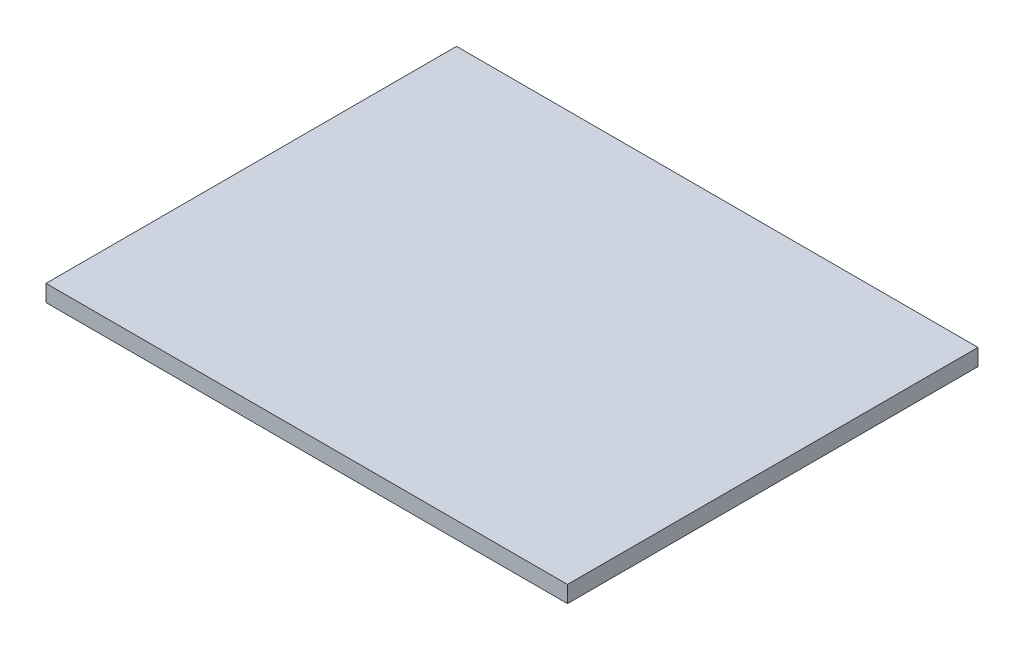
ISO-10303-21;
HEADER;
FILE_DESCRIPTION(('STEP AP214'),'2;1');
FILE_NAME('part.step','',(''),(''),'','','');
FILE_SCHEMA(('AUTOMOTIVE_DESIGN { 1 0 10303 214 1 1 1 1 }'));
ENDSEC;
DATA;
#1=APPLICATION_CONTEXT('core data for automotive mechanical design processes');
#2=APPLICATION_PROTOCOL_DEFINITION('international standard','automotive_design',2000,#1);
#3=PRODUCT_CONTEXT('',#1,'mechanical');
#4=PRODUCT('Part','Part','',(#3));
#5=PRODUCT_RELATED_PRODUCT_CATEGORY('part','',(#4));
#6=PRODUCT_DEFINITION_FORMATION('','',#4);
#7=PRODUCT_DEFINITION_CONTEXT('part definition',#1,'design');
#8=PRODUCT_DEFINITION('design','',#6,#7);
#9=PRODUCT_DEFINITION_SHAPE('','',#8);
#10=(LENGTH_UNIT() NAMED_UNIT(*) SI_UNIT(.MILLI.,.METRE.));
#11=(NAMED_UNIT(*) PLANE_ANGLE_UNIT() SI_UNIT($,.RADIAN.));
#12=(NAMED_UNIT(*) SI_UNIT($,.STERADIAN.) SOLID_ANGLE_UNIT());
#13=UNCERTAINTY_MEASURE_WITH_UNIT(LENGTH_MEASURE(1.E-05),#10,'distance_accuracy_value','');
#14=(GEOMETRIC_REPRESENTATION_CONTEXT(3) GLOBAL_UNCERTAINTY_ASSIGNED_CONTEXT((#13)) GLOBAL_UNIT_ASSIGNED_CONTEXT((#10,
#11,#12)) REPRESENTATION_CONTEXT('',''));
#15=CARTESIAN_POINT('',(0.,0.,0.));
#16=DIRECTION('',(0.,0.,1.));
#17=DIRECTION('',(1.,0.,0.));
#18=AXIS2_PLACEMENT_3D('',#15,#16,#17);
#19=CARTESIAN_POINT('',(47.,3.,-37.));
#20=DIRECTION('',(-1.,0.,0.));
#21=DIRECTION('',(0.,0.,1.));
#22=AXIS2_PLACEMENT_3D('',#19,#20,#21);
#23=PLANE('',#22);
#24=DIRECTION('',(0.,0.,-1.));
#25=VECTOR('',#24,1.);
#26=CARTESIAN_POINT('',(47.,0.,-37.));
#27=LINE('',#26,#25);
#28=CARTESIAN_POINT('',(47.,0.,37.));
#29=VERTEX_POINT('',#28);
#30=CARTESIAN_POINT('',(47.,0.,-37.));
#31=VERTEX_POINT('',#30);
#32=EDGE_CURVE('E113',#29,#31,#27,.T.);
#33=ORIENTED_EDGE('',*,*,#32,.T.);
#34=DIRECTION('',(0.,-1.,0.));
#35=VECTOR('',#34,1.);
#36=CARTESIAN_POINT('',(47.,3.,-37.));
#37=LINE('',#36,#35);
#38=CARTESIAN_POINT('',(47.,3.,-37.));
#39=VERTEX_POINT('',#38);
#40=EDGE_CURVE('E11',#39,#31,#37,.T.);
#41=ORIENTED_EDGE('',*,*,#40,.F.);
#42=DIRECTION('',(0.,0.,-1.));
#43=VECTOR('',#42,1.);
#44=CARTESIAN_POINT('',(47.,3.,-37.));
#45=LINE('',#44,#43);
#46=CARTESIAN_POINT('',(47.,3.,37.));
#47=VERTEX_POINT('',#46);
#48=EDGE_CURVE('E97',#47,#39,#45,.T.);
#49=ORIENTED_EDGE('',*,*,#48,.F.);
#50=DIRECTION('',(0.,-1.,0.));
#51=VECTOR('',#50,1.);
#52=CARTESIAN_POINT('',(47.,3.,37.));
#53=LINE('',#52,#51);
#54=EDGE_CURVE('E109',#47,#29,#53,.T.);
#55=ORIENTED_EDGE('',*,*,#54,.T.);
#56=EDGE_LOOP('',(#33,#41,#49,#55));
#57=FACE_BOUND('',#56,.T.);
#58=ADVANCED_FACE('F45',(#57),#23,.F.);
#59=CARTESIAN_POINT('',(-47.,3.,-37.));
#60=DIRECTION('',(0.,0.,1.));
#61=DIRECTION('',(1.,0.,0.));
#62=AXIS2_PLACEMENT_3D('',#59,#60,#61);
#63=PLANE('',#62);
#64=DIRECTION('',(-1.,0.,0.));
#65=VECTOR('',#64,1.);
#66=CARTESIAN_POINT('',(-47.,0.,-37.));
#67=LINE('',#66,#65);
#68=CARTESIAN_POINT('',(-47.,0.,-37.));
#69=VERTEX_POINT('',#68);
#70=EDGE_CURVE('E102',#31,#69,#67,.T.);
#71=ORIENTED_EDGE('',*,*,#70,.T.);
#72=DIRECTION('',(0.,-1.,0.));
#73=VECTOR('',#72,1.);
#74=CARTESIAN_POINT('',(-47.,3.,-37.));
#75=LINE('',#74,#73);
#76=CARTESIAN_POINT('',(-47.,3.,-37.));
#77=VERTEX_POINT('',#76);
#78=EDGE_CURVE('E54',#77,#69,#75,.T.);
#79=ORIENTED_EDGE('',*,*,#78,.F.);
#80=DIRECTION('',(-1.,0.,0.));
#81=VECTOR('',#80,1.);
#82=CARTESIAN_POINT('',(-47.,3.,-37.));
#83=LINE('',#82,#81);
#84=EDGE_CURVE('E92',#39,#77,#83,.T.);
#85=ORIENTED_EDGE('',*,*,#84,.F.);
#86=ORIENTED_EDGE('',*,*,#40,.T.);
#87=EDGE_LOOP('',(#71,#79,#85,#86));
#88=FACE_BOUND('',#87,.T.);
#89=ADVANCED_FACE('F101',(#88),#63,.F.);
#90=CARTESIAN_POINT('',(-47.,3.,-37.));
#91=DIRECTION('',(1.,0.,0.));
#92=DIRECTION('',(0.,0.,-1.));
#93=AXIS2_PLACEMENT_3D('',#90,#91,#92);
#94=PLANE('',#93);
#95=DIRECTION('',(0.,0.,1.));
#96=VECTOR('',#95,1.);
#97=CARTESIAN_POINT('',(-47.,0.,-37.));
#98=LINE('',#97,#96);
#99=CARTESIAN_POINT('',(-47.,0.,37.));
#100=VERTEX_POINT('',#99);
#101=EDGE_CURVE('E79',#69,#100,#98,.T.);
#102=ORIENTED_EDGE('',*,*,#101,.T.);
#103=DIRECTION('',(0.,-1.,0.));
#104=VECTOR('',#103,1.);
#105=CARTESIAN_POINT('',(-47.,3.,37.));
#106=LINE('',#105,#104);
#107=CARTESIAN_POINT('',(-47.,3.,37.));
#108=VERTEX_POINT('',#107);
#109=EDGE_CURVE('E104',#108,#100,#106,.T.);
#110=ORIENTED_EDGE('',*,*,#109,.F.);
#111=DIRECTION('',(0.,0.,1.));
#112=VECTOR('',#111,1.);
#113=CARTESIAN_POINT('',(-47.,3.,-37.));
#114=LINE('',#113,#112);
#115=EDGE_CURVE('E95',#77,#108,#114,.T.);
#116=ORIENTED_EDGE('',*,*,#115,.F.);
#117=ORIENTED_EDGE('',*,*,#78,.T.);
#118=EDGE_LOOP('',(#102,#110,#116,#117));
#119=FACE_BOUND('',#118,.T.);
#120=ADVANCED_FACE('F105',(#119),#94,.F.);
#121=CARTESIAN_POINT('',(-47.,3.,37.));
#122=DIRECTION('',(0.,0.,-1.));
#123=DIRECTION('',(-1.,0.,0.));
#124=AXIS2_PLACEMENT_3D('',#121,#122,#123);
#125=PLANE('',#124);
#126=DIRECTION('',(1.,0.,0.));
#127=VECTOR('',#126,1.);
#128=CARTESIAN_POINT('',(-47.,0.,37.));
#129=LINE('',#128,#127);
#130=EDGE_CURVE('E85',#100,#29,#129,.T.);
#131=ORIENTED_EDGE('',*,*,#130,.T.);
#132=ORIENTED_EDGE('',*,*,#54,.F.);
#133=DIRECTION('',(1.,0.,0.));
#134=VECTOR('',#133,1.);
#135=CARTESIAN_POINT('',(-47.,3.,37.));
#136=LINE('',#135,#134);
#137=EDGE_CURVE('E62',#108,#47,#136,.T.);
#138=ORIENTED_EDGE('',*,*,#137,.F.);
#139=ORIENTED_EDGE('',*,*,#109,.T.);
#140=EDGE_LOOP('',(#131,#132,#138,#139));
#141=FACE_BOUND('',#140,.T.);
#142=ADVANCED_FACE('F126',(#141),#125,.F.);
#143=CARTESIAN_POINT('',(0.,3.,0.));
#144=DIRECTION('',(0.,1.,0.));
#145=DIRECTION('',(0.,0.,1.));
#146=AXIS2_PLACEMENT_3D('',#143,#144,#145);
#147=PLANE('',#146);
#148=ORIENTED_EDGE('',*,*,#48,.T.);
#149=ORIENTED_EDGE('',*,*,#84,.T.);
#150=ORIENTED_EDGE('',*,*,#115,.T.);
#151=ORIENTED_EDGE('',*,*,#137,.T.);
#152=EDGE_LOOP('',(#148,#149,#150,#151));
#153=FACE_BOUND('',#152,.T.);
#154=ADVANCED_FACE('F93',(#153),#147,.T.);
#155=CARTESIAN_POINT('',(0.,0.,0.));
#156=DIRECTION('',(0.,1.,0.));
#157=DIRECTION('',(0.,0.,1.));
#158=AXIS2_PLACEMENT_3D('',#155,#156,#157);
#159=PLANE('',#158);
#160=ORIENTED_EDGE('',*,*,#32,.F.);
#161=ORIENTED_EDGE('',*,*,#130,.F.);
#162=ORIENTED_EDGE('',*,*,#101,.F.);
#163=ORIENTED_EDGE('',*,*,#70,.F.);
#164=EDGE_LOOP('',(#160,#161,#162,#163));
#165=FACE_BOUND('',#164,.T.);
#166=ADVANCED_FACE('F129',(#165),#159,.F.);
#167=CLOSED_SHELL('',(#58,#89,#120,#142,#154,#166));
#168=MANIFOLD_SOLID_BREP('B2',#167);
#169=ADVANCED_BREP_SHAPE_REPRESENTATION('',(#18,#168),#14);
#170=SHAPE_DEFINITION_REPRESENTATION(#9,#169);
ENDSEC;
END-ISO-10303-21;
